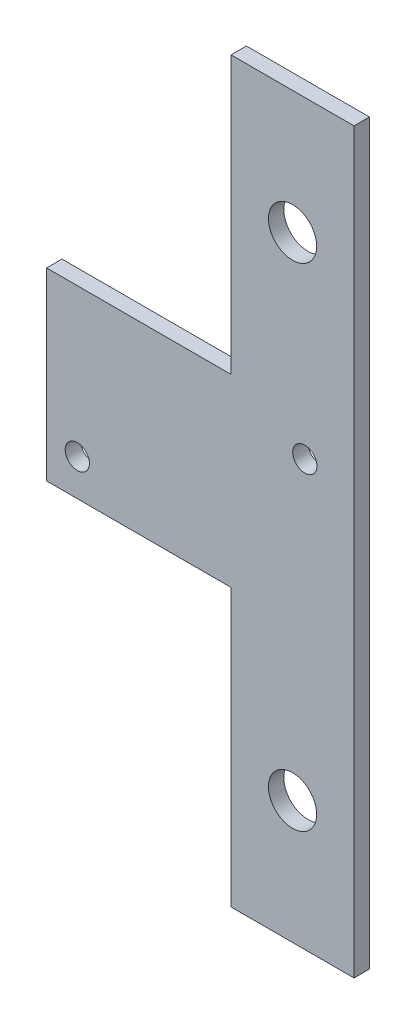
ISO-10303-21;
HEADER;
FILE_DESCRIPTION(('STEP AP214'),'2;1');
FILE_NAME('part.step','',(''),(''),'','','');
FILE_SCHEMA(('AUTOMOTIVE_DESIGN { 1 0 10303 214 1 1 1 1 }'));
ENDSEC;
DATA;
#1=APPLICATION_CONTEXT('core data for automotive mechanical design processes');
#2=APPLICATION_PROTOCOL_DEFINITION('international standard','automotive_design',2000,#1);
#3=PRODUCT_CONTEXT('',#1,'mechanical');
#4=PRODUCT('Part','Part','',(#3));
#5=PRODUCT_RELATED_PRODUCT_CATEGORY('part','',(#4));
#6=PRODUCT_DEFINITION_FORMATION('','',#4);
#7=PRODUCT_DEFINITION_CONTEXT('part definition',#1,'design');
#8=PRODUCT_DEFINITION('design','',#6,#7);
#9=PRODUCT_DEFINITION_SHAPE('','',#8);
#10=(LENGTH_UNIT() NAMED_UNIT(*) SI_UNIT(.MILLI.,.METRE.));
#11=(NAMED_UNIT(*) PLANE_ANGLE_UNIT() SI_UNIT($,.RADIAN.));
#12=(NAMED_UNIT(*) SI_UNIT($,.STERADIAN.) SOLID_ANGLE_UNIT());
#13=UNCERTAINTY_MEASURE_WITH_UNIT(LENGTH_MEASURE(1.E-05),#10,'distance_accuracy_value','');
#14=(GEOMETRIC_REPRESENTATION_CONTEXT(3) GLOBAL_UNCERTAINTY_ASSIGNED_CONTEXT((#13)) GLOBAL_UNIT_ASSIGNED_CONTEXT((#10,
#11,#12)) REPRESENTATION_CONTEXT('',''));
#15=CARTESIAN_POINT('',(0.,0.,0.));
#16=DIRECTION('',(0.,0.,1.));
#17=DIRECTION('',(1.,0.,0.));
#18=AXIS2_PLACEMENT_3D('',#15,#16,#17);
#19=CARTESIAN_POINT('',(0.,0.,1.5875));
#20=DIRECTION('',(0.,0.,-1.));
#21=DIRECTION('',(-1.,0.,0.));
#22=AXIS2_PLACEMENT_3D('',#19,#20,#21);
#23=PLANE('',#22);
#24=DIRECTION('',(0.,1.,0.));
#25=VECTOR('',#24,1.);
#26=CARTESIAN_POINT('',(-12.3843317987591,1046.594541193,1.5875));
#27=LINE('',#26,#25);
#28=CARTESIAN_POINT('',(-12.3843317987591,970.394541192996,1.5875));
#29=VERTEX_POINT('',#28);
#30=CARTESIAN_POINT('',(-12.3843317987591,1046.594541193,1.5875));
#31=VERTEX_POINT('',#30);
#32=EDGE_CURVE('E146',#29,#31,#27,.T.);
#33=ORIENTED_EDGE('',*,*,#32,.T.);
#34=DIRECTION('',(-1.,0.,0.));
#35=VECTOR('',#34,1.);
#36=CARTESIAN_POINT('',(-25.0843317987591,1046.594541193,1.5875));
#37=LINE('',#36,#35);
#38=CARTESIAN_POINT('',(-25.0843317987591,1046.594541193,1.5875));
#39=VERTEX_POINT('',#38);
#40=EDGE_CURVE('E94',#31,#39,#37,.T.);
#41=ORIENTED_EDGE('',*,*,#40,.T.);
#42=DIRECTION('',(0.,-1.,0.));
#43=VECTOR('',#42,1.);
#44=CARTESIAN_POINT('',(-25.0843317987591,1018.019541193,1.5875));
#45=LINE('',#44,#43);
#46=CARTESIAN_POINT('',(-25.0843317987591,1018.019541193,1.5875));
#47=VERTEX_POINT('',#46);
#48=EDGE_CURVE('E161',#39,#47,#45,.T.);
#49=ORIENTED_EDGE('',*,*,#48,.T.);
#50=DIRECTION('',(-1.,0.,0.));
#51=VECTOR('',#50,1.);
#52=CARTESIAN_POINT('',(-44.1343317987591,1018.019541193,1.5875));
#53=LINE('',#52,#51);
#54=CARTESIAN_POINT('',(-44.1343317987591,1018.019541193,1.5875));
#55=VERTEX_POINT('',#54);
#56=EDGE_CURVE('E174',#47,#55,#53,.T.);
#57=ORIENTED_EDGE('',*,*,#56,.T.);
#58=DIRECTION('',(0.,-1.,0.));
#59=VECTOR('',#58,1.);
#60=CARTESIAN_POINT('',(-44.1343317987591,998.969541192996,1.5875));
#61=LINE('',#60,#59);
#62=CARTESIAN_POINT('',(-44.1343317987591,998.969541192996,1.5875));
#63=VERTEX_POINT('',#62);
#64=EDGE_CURVE('E113',#55,#63,#61,.T.);
#65=ORIENTED_EDGE('',*,*,#64,.T.);
#66=DIRECTION('',(1.,0.,0.));
#67=VECTOR('',#66,1.);
#68=CARTESIAN_POINT('',(-25.0843317987591,998.969541192996,1.5875));
#69=LINE('',#68,#67);
#70=CARTESIAN_POINT('',(-25.0843317987591,998.969541192996,1.5875));
#71=VERTEX_POINT('',#70);
#72=EDGE_CURVE('E107',#63,#71,#69,.T.);
#73=ORIENTED_EDGE('',*,*,#72,.T.);
#74=DIRECTION('',(0.,-1.,0.));
#75=VECTOR('',#74,1.);
#76=CARTESIAN_POINT('',(-25.0843317987591,970.394541192996,1.5875));
#77=LINE('',#76,#75);
#78=CARTESIAN_POINT('',(-25.0843317987591,970.394541192996,1.5875));
#79=VERTEX_POINT('',#78);
#80=EDGE_CURVE('E111',#71,#79,#77,.T.);
#81=ORIENTED_EDGE('',*,*,#80,.T.);
#82=DIRECTION('',(1.,0.,0.));
#83=VECTOR('',#82,1.);
#84=CARTESIAN_POINT('',(-12.3843317987591,970.394541192996,1.5875));
#85=LINE('',#84,#83);
#86=EDGE_CURVE('E51',#79,#29,#85,.T.);
#87=ORIENTED_EDGE('',*,*,#86,.T.);
#88=EDGE_LOOP('',(#33,#41,#49,#57,#65,#73,#81,#87));
#89=FACE_BOUND('',#88,.T.);
#90=CARTESIAN_POINT('',(-18.7343317987591,983.094541192996,1.5875));
#91=DIRECTION('',(0.,0.,1.));
#92=DIRECTION('',(1.,0.,0.));
#93=AXIS2_PLACEMENT_3D('',#90,#91,#92);
#94=CIRCLE('',#93,2.48919999999997);
#95=CARTESIAN_POINT('',(-16.2451317987591,983.094541192996,1.5875));
#96=VERTEX_POINT('',#95);
#97=EDGE_CURVE('E135',#96,#96,#94,.T.);
#98=ORIENTED_EDGE('',*,*,#97,.F.);
#99=EDGE_LOOP('',(#98));
#100=FACE_BOUND('',#99,.T.);
#101=CARTESIAN_POINT('',(-18.7343317987591,1033.894541193,1.5875));
#102=DIRECTION('',(0.,0.,1.));
#103=DIRECTION('',(1.,0.,0.));
#104=AXIS2_PLACEMENT_3D('',#101,#102,#103);
#105=CIRCLE('',#104,2.48920000000004);
#106=CARTESIAN_POINT('',(-16.2451317987591,1033.894541193,1.5875));
#107=VERTEX_POINT('',#106);
#108=EDGE_CURVE('E183',#107,#107,#105,.T.);
#109=ORIENTED_EDGE('',*,*,#108,.F.);
#110=EDGE_LOOP('',(#109));
#111=FACE_BOUND('',#110,.T.);
#112=CARTESIAN_POINT('',(-40.9593317987591,1002.73627543313,1.5875));
#113=DIRECTION('',(0.,0.,1.));
#114=DIRECTION('',(1.,0.,0.));
#115=AXIS2_PLACEMENT_3D('',#112,#113,#114);
#116=CIRCLE('',#115,1.25000000000005);
#117=CARTESIAN_POINT('',(-39.709331798759,1002.73627543313,1.5875));
#118=VERTEX_POINT('',#117);
#119=EDGE_CURVE('E189',#118,#118,#116,.T.);
#120=ORIENTED_EDGE('',*,*,#119,.F.);
#121=EDGE_LOOP('',(#120));
#122=FACE_BOUND('',#121,.T.);
#123=CARTESIAN_POINT('',(-17.4674288207591,1014.25280695286,1.5875));
#124=DIRECTION('',(0.,0.,1.));
#125=DIRECTION('',(1.,0.,0.));
#126=AXIS2_PLACEMENT_3D('',#123,#124,#125);
#127=CIRCLE('',#126,1.25000000000019);
#128=CARTESIAN_POINT('',(-16.2174288207589,1014.25280695286,1.5875));
#129=VERTEX_POINT('',#128);
#130=EDGE_CURVE('E195',#129,#129,#127,.T.);
#131=ORIENTED_EDGE('',*,*,#130,.F.);
#132=EDGE_LOOP('',(#131));
#133=FACE_BOUND('',#132,.T.);
#134=ADVANCED_FACE('F34',(#89,#100,#111,#122,#133),#23,.F.);
#135=CARTESIAN_POINT('',(0.,0.,0.));
#136=DIRECTION('',(0.,0.,-1.));
#137=DIRECTION('',(-1.,0.,0.));
#138=AXIS2_PLACEMENT_3D('',#135,#136,#137);
#139=PLANE('',#138);
#140=CARTESIAN_POINT('',(-40.9593317987591,1002.73627543313,0.));
#141=DIRECTION('',(0.,0.,1.));
#142=DIRECTION('',(1.,0.,0.));
#143=AXIS2_PLACEMENT_3D('',#140,#141,#142);
#144=CIRCLE('',#143,1.25000000000005);
#145=CARTESIAN_POINT('',(-39.709331798759,1002.73627543313,0.));
#146=VERTEX_POINT('',#145);
#147=EDGE_CURVE('E192',#146,#146,#144,.T.);
#148=ORIENTED_EDGE('',*,*,#147,.T.);
#149=EDGE_LOOP('',(#148));
#150=FACE_BOUND('',#149,.T.);
#151=CARTESIAN_POINT('',(-18.7343317987591,983.094541192996,0.));
#152=DIRECTION('',(0.,0.,1.));
#153=DIRECTION('',(1.,0.,0.));
#154=AXIS2_PLACEMENT_3D('',#151,#152,#153);
#155=CIRCLE('',#154,2.48919999999997);
#156=CARTESIAN_POINT('',(-16.2451317987591,983.094541192996,0.));
#157=VERTEX_POINT('',#156);
#158=EDGE_CURVE('E180',#157,#157,#155,.T.);
#159=ORIENTED_EDGE('',*,*,#158,.T.);
#160=EDGE_LOOP('',(#159));
#161=FACE_BOUND('',#160,.T.);
#162=DIRECTION('',(0.,1.,0.));
#163=VECTOR('',#162,1.);
#164=CARTESIAN_POINT('',(-12.3843317987591,1046.594541193,0.));
#165=LINE('',#164,#163);
#166=CARTESIAN_POINT('',(-12.3843317987591,970.394541192996,0.));
#167=VERTEX_POINT('',#166);
#168=CARTESIAN_POINT('',(-12.3843317987591,1046.594541193,0.));
#169=VERTEX_POINT('',#168);
#170=EDGE_CURVE('E131',#167,#169,#165,.T.);
#171=ORIENTED_EDGE('',*,*,#170,.F.);
#172=DIRECTION('',(1.,0.,0.));
#173=VECTOR('',#172,1.);
#174=CARTESIAN_POINT('',(-12.3843317987591,970.394541192996,0.));
#175=LINE('',#174,#173);
#176=CARTESIAN_POINT('',(-25.0843317987591,970.394541192996,0.));
#177=VERTEX_POINT('',#176);
#178=EDGE_CURVE('E86',#177,#167,#175,.T.);
#179=ORIENTED_EDGE('',*,*,#178,.F.);
#180=DIRECTION('',(0.,-1.,0.));
#181=VECTOR('',#180,1.);
#182=CARTESIAN_POINT('',(-25.0843317987591,970.394541192996,0.));
#183=LINE('',#182,#181);
#184=CARTESIAN_POINT('',(-25.0843317987591,998.969541192996,0.));
#185=VERTEX_POINT('',#184);
#186=EDGE_CURVE('E80',#185,#177,#183,.T.);
#187=ORIENTED_EDGE('',*,*,#186,.F.);
#188=DIRECTION('',(1.,0.,0.));
#189=VECTOR('',#188,1.);
#190=CARTESIAN_POINT('',(-25.0843317987591,998.969541192996,0.));
#191=LINE('',#190,#189);
#192=CARTESIAN_POINT('',(-44.1343317987591,998.969541192996,0.));
#193=VERTEX_POINT('',#192);
#194=EDGE_CURVE('E121',#193,#185,#191,.T.);
#195=ORIENTED_EDGE('',*,*,#194,.F.);
#196=DIRECTION('',(0.,-1.,0.));
#197=VECTOR('',#196,1.);
#198=CARTESIAN_POINT('',(-44.1343317987591,998.969541192996,0.));
#199=LINE('',#198,#197);
#200=CARTESIAN_POINT('',(-44.1343317987591,1018.019541193,0.));
#201=VERTEX_POINT('',#200);
#202=EDGE_CURVE('E141',#201,#193,#199,.T.);
#203=ORIENTED_EDGE('',*,*,#202,.F.);
#204=DIRECTION('',(-1.,0.,0.));
#205=VECTOR('',#204,1.);
#206=CARTESIAN_POINT('',(-44.1343317987591,1018.019541193,0.));
#207=LINE('',#206,#205);
#208=CARTESIAN_POINT('',(-25.0843317987591,1018.019541193,0.));
#209=VERTEX_POINT('',#208);
#210=EDGE_CURVE('E139',#209,#201,#207,.T.);
#211=ORIENTED_EDGE('',*,*,#210,.F.);
#212=DIRECTION('',(0.,-1.,0.));
#213=VECTOR('',#212,1.);
#214=CARTESIAN_POINT('',(-25.0843317987591,1018.019541193,0.));
#215=LINE('',#214,#213);
#216=CARTESIAN_POINT('',(-25.0843317987591,1046.594541193,0.));
#217=VERTEX_POINT('',#216);
#218=EDGE_CURVE('E137',#217,#209,#215,.T.);
#219=ORIENTED_EDGE('',*,*,#218,.F.);
#220=DIRECTION('',(-1.,0.,0.));
#221=VECTOR('',#220,1.);
#222=CARTESIAN_POINT('',(-25.0843317987591,1046.594541193,0.));
#223=LINE('',#222,#221);
#224=EDGE_CURVE('E134',#169,#217,#223,.T.);
#225=ORIENTED_EDGE('',*,*,#224,.F.);
#226=EDGE_LOOP('',(#171,#179,#187,#195,#203,#211,#219,#225));
#227=FACE_BOUND('',#226,.T.);
#228=CARTESIAN_POINT('',(-18.7343317987591,1033.894541193,0.));
#229=DIRECTION('',(0.,0.,1.));
#230=DIRECTION('',(1.,0.,0.));
#231=AXIS2_PLACEMENT_3D('',#228,#229,#230);
#232=CIRCLE('',#231,2.48920000000004);
#233=CARTESIAN_POINT('',(-16.2451317987591,1033.894541193,0.));
#234=VERTEX_POINT('',#233);
#235=EDGE_CURVE('E186',#234,#234,#232,.T.);
#236=ORIENTED_EDGE('',*,*,#235,.T.);
#237=EDGE_LOOP('',(#236));
#238=FACE_BOUND('',#237,.T.);
#239=CARTESIAN_POINT('',(-17.4674288207591,1014.25280695286,0.));
#240=DIRECTION('',(0.,0.,1.));
#241=DIRECTION('',(1.,0.,0.));
#242=AXIS2_PLACEMENT_3D('',#239,#240,#241);
#243=CIRCLE('',#242,1.25000000000019);
#244=CARTESIAN_POINT('',(-16.2174288207589,1014.25280695286,0.));
#245=VERTEX_POINT('',#244);
#246=EDGE_CURVE('E198',#245,#245,#243,.T.);
#247=ORIENTED_EDGE('',*,*,#246,.T.);
#248=EDGE_LOOP('',(#247));
#249=FACE_BOUND('',#248,.T.);
#250=ADVANCED_FACE('F165',(#150,#161,#227,#238,#249),#139,.T.);
#251=CARTESIAN_POINT('',(-12.3843317987591,1046.594541193,1.5875));
#252=DIRECTION('',(-1.,0.,0.));
#253=DIRECTION('',(0.,-1.,0.));
#254=AXIS2_PLACEMENT_3D('',#251,#252,#253);
#255=PLANE('',#254);
#256=ORIENTED_EDGE('',*,*,#170,.T.);
#257=DIRECTION('',(0.,0.,-1.));
#258=VECTOR('',#257,1.);
#259=CARTESIAN_POINT('',(-12.3843317987591,1046.594541193,1.5875));
#260=LINE('',#259,#258);
#261=EDGE_CURVE('E11',#31,#169,#260,.T.);
#262=ORIENTED_EDGE('',*,*,#261,.F.);
#263=ORIENTED_EDGE('',*,*,#32,.F.);
#264=DIRECTION('',(0.,0.,-1.));
#265=VECTOR('',#264,1.);
#266=CARTESIAN_POINT('',(-12.3843317987591,970.394541192996,1.5875));
#267=LINE('',#266,#265);
#268=EDGE_CURVE('E127',#29,#167,#267,.T.);
#269=ORIENTED_EDGE('',*,*,#268,.T.);
#270=EDGE_LOOP('',(#256,#262,#263,#269));
#271=FACE_BOUND('',#270,.T.);
#272=ADVANCED_FACE('F36',(#271),#255,.F.);
#273=CARTESIAN_POINT('',(-25.0843317987591,1046.594541193,1.5875));
#274=DIRECTION('',(0.,-1.,0.));
#275=DIRECTION('',(1.,0.,0.));
#276=AXIS2_PLACEMENT_3D('',#273,#274,#275);
#277=PLANE('',#276);
#278=ORIENTED_EDGE('',*,*,#224,.T.);
#279=DIRECTION('',(0.,0.,-1.));
#280=VECTOR('',#279,1.);
#281=CARTESIAN_POINT('',(-25.0843317987591,1046.594541193,1.5875));
#282=LINE('',#281,#280);
#283=EDGE_CURVE('E43',#39,#217,#282,.T.);
#284=ORIENTED_EDGE('',*,*,#283,.F.);
#285=ORIENTED_EDGE('',*,*,#40,.F.);
#286=ORIENTED_EDGE('',*,*,#261,.T.);
#287=EDGE_LOOP('',(#278,#284,#285,#286));
#288=FACE_BOUND('',#287,.T.);
#289=ADVANCED_FACE('F230',(#288),#277,.F.);
#290=CARTESIAN_POINT('',(-25.0843317987591,1018.019541193,1.5875));
#291=DIRECTION('',(1.,0.,0.));
#292=DIRECTION('',(0.,1.,0.));
#293=AXIS2_PLACEMENT_3D('',#290,#291,#292);
#294=PLANE('',#293);
#295=ORIENTED_EDGE('',*,*,#218,.T.);
#296=DIRECTION('',(0.,0.,-1.));
#297=VECTOR('',#296,1.);
#298=CARTESIAN_POINT('',(-25.0843317987591,1018.019541193,1.5875));
#299=LINE('',#298,#297);
#300=EDGE_CURVE('E153',#47,#209,#299,.T.);
#301=ORIENTED_EDGE('',*,*,#300,.F.);
#302=ORIENTED_EDGE('',*,*,#48,.F.);
#303=ORIENTED_EDGE('',*,*,#283,.T.);
#304=EDGE_LOOP('',(#295,#301,#302,#303));
#305=FACE_BOUND('',#304,.T.);
#306=ADVANCED_FACE('F159',(#305),#294,.F.);
#307=CARTESIAN_POINT('',(-44.1343317987591,1018.019541193,1.5875));
#308=DIRECTION('',(0.,-1.,0.));
#309=DIRECTION('',(0.,0.,-1.));
#310=AXIS2_PLACEMENT_3D('',#307,#308,#309);
#311=PLANE('',#310);
#312=ORIENTED_EDGE('',*,*,#210,.T.);
#313=DIRECTION('',(0.,0.,-1.));
#314=VECTOR('',#313,1.);
#315=CARTESIAN_POINT('',(-44.1343317987591,1018.019541193,1.5875));
#316=LINE('',#315,#314);
#317=EDGE_CURVE('E150',#55,#201,#316,.T.);
#318=ORIENTED_EDGE('',*,*,#317,.F.);
#319=ORIENTED_EDGE('',*,*,#56,.F.);
#320=ORIENTED_EDGE('',*,*,#300,.T.);
#321=EDGE_LOOP('',(#312,#318,#319,#320));
#322=FACE_BOUND('',#321,.T.);
#323=ADVANCED_FACE('F170',(#322),#311,.F.);
#324=CARTESIAN_POINT('',(-44.1343317987591,998.969541192996,1.5875));
#325=DIRECTION('',(1.,0.,0.));
#326=DIRECTION('',(0.,1.,0.));
#327=AXIS2_PLACEMENT_3D('',#324,#325,#326);
#328=PLANE('',#327);
#329=ORIENTED_EDGE('',*,*,#202,.T.);
#330=DIRECTION('',(0.,0.,-1.));
#331=VECTOR('',#330,1.);
#332=CARTESIAN_POINT('',(-44.1343317987591,998.969541192996,1.5875));
#333=LINE('',#332,#331);
#334=EDGE_CURVE('E122',#63,#193,#333,.T.);
#335=ORIENTED_EDGE('',*,*,#334,.F.);
#336=ORIENTED_EDGE('',*,*,#64,.F.);
#337=ORIENTED_EDGE('',*,*,#317,.T.);
#338=EDGE_LOOP('',(#329,#335,#336,#337));
#339=FACE_BOUND('',#338,.T.);
#340=ADVANCED_FACE('F173',(#339),#328,.F.);
#341=CARTESIAN_POINT('',(-25.0843317987591,998.969541192996,1.5875));
#342=DIRECTION('',(0.,1.,0.));
#343=DIRECTION('',(-1.,0.,0.));
#344=AXIS2_PLACEMENT_3D('',#341,#342,#343);
#345=PLANE('',#344);
#346=ORIENTED_EDGE('',*,*,#194,.T.);
#347=DIRECTION('',(0.,0.,-1.));
#348=VECTOR('',#347,1.);
#349=CARTESIAN_POINT('',(-25.0843317987591,998.969541192996,1.5875));
#350=LINE('',#349,#348);
#351=EDGE_CURVE('E118',#71,#185,#350,.T.);
#352=ORIENTED_EDGE('',*,*,#351,.F.);
#353=ORIENTED_EDGE('',*,*,#72,.F.);
#354=ORIENTED_EDGE('',*,*,#334,.T.);
#355=EDGE_LOOP('',(#346,#352,#353,#354));
#356=FACE_BOUND('',#355,.T.);
#357=ADVANCED_FACE('F119',(#356),#345,.F.);
#358=CARTESIAN_POINT('',(-25.0843317987591,970.394541192996,1.5875));
#359=DIRECTION('',(1.,0.,0.));
#360=DIRECTION('',(0.,1.,0.));
#361=AXIS2_PLACEMENT_3D('',#358,#359,#360);
#362=PLANE('',#361);
#363=ORIENTED_EDGE('',*,*,#186,.T.);
#364=DIRECTION('',(0.,0.,-1.));
#365=VECTOR('',#364,1.);
#366=CARTESIAN_POINT('',(-25.0843317987591,970.394541192996,1.5875));
#367=LINE('',#366,#365);
#368=EDGE_CURVE('E123',#79,#177,#367,.T.);
#369=ORIENTED_EDGE('',*,*,#368,.F.);
#370=ORIENTED_EDGE('',*,*,#80,.F.);
#371=ORIENTED_EDGE('',*,*,#351,.T.);
#372=EDGE_LOOP('',(#363,#369,#370,#371));
#373=FACE_BOUND('',#372,.T.);
#374=ADVANCED_FACE('F125',(#373),#362,.F.);
#375=CARTESIAN_POINT('',(-12.3843317987591,970.394541192996,1.5875));
#376=DIRECTION('',(0.,1.,0.));
#377=DIRECTION('',(-1.,0.,0.));
#378=AXIS2_PLACEMENT_3D('',#375,#376,#377);
#379=PLANE('',#378);
#380=ORIENTED_EDGE('',*,*,#178,.T.);
#381=ORIENTED_EDGE('',*,*,#268,.F.);
#382=ORIENTED_EDGE('',*,*,#86,.F.);
#383=ORIENTED_EDGE('',*,*,#368,.T.);
#384=EDGE_LOOP('',(#380,#381,#382,#383));
#385=FACE_BOUND('',#384,.T.);
#386=ADVANCED_FACE('F218',(#385),#379,.F.);
#387=CARTESIAN_POINT('',(-18.7343317987591,983.094541192996,1.5875));
#388=DIRECTION('',(0.,0.,-1.));
#389=DIRECTION('',(-1.,0.,0.));
#390=AXIS2_PLACEMENT_3D('',#387,#388,#389);
#391=CYLINDRICAL_SURFACE('',#390,2.48919999999997);
#392=ORIENTED_EDGE('',*,*,#97,.T.);
#393=EDGE_LOOP('',(#392));
#394=FACE_BOUND('',#393,.T.);
#395=ORIENTED_EDGE('',*,*,#158,.F.);
#396=EDGE_LOOP('',(#395));
#397=FACE_BOUND('',#396,.T.);
#398=ADVANCED_FACE('F215',(#394,#397),#391,.F.);
#399=CARTESIAN_POINT('',(-18.7343317987591,1033.894541193,1.5875));
#400=DIRECTION('',(0.,0.,-1.));
#401=DIRECTION('',(-1.,0.,0.));
#402=AXIS2_PLACEMENT_3D('',#399,#400,#401);
#403=CYLINDRICAL_SURFACE('',#402,2.48920000000004);
#404=ORIENTED_EDGE('',*,*,#108,.T.);
#405=EDGE_LOOP('',(#404));
#406=FACE_BOUND('',#405,.T.);
#407=ORIENTED_EDGE('',*,*,#235,.F.);
#408=EDGE_LOOP('',(#407));
#409=FACE_BOUND('',#408,.T.);
#410=ADVANCED_FACE('F294',(#406,#409),#403,.F.);
#411=CARTESIAN_POINT('',(-40.9593317987591,1002.73627543313,1.5875));
#412=DIRECTION('',(0.,0.,-1.));
#413=DIRECTION('',(-1.,0.,0.));
#414=AXIS2_PLACEMENT_3D('',#411,#412,#413);
#415=CYLINDRICAL_SURFACE('',#414,1.25000000000005);
#416=ORIENTED_EDGE('',*,*,#119,.T.);
#417=EDGE_LOOP('',(#416));
#418=FACE_BOUND('',#417,.T.);
#419=ORIENTED_EDGE('',*,*,#147,.F.);
#420=EDGE_LOOP('',(#419));
#421=FACE_BOUND('',#420,.T.);
#422=ADVANCED_FACE('F302',(#418,#421),#415,.F.);
#423=CARTESIAN_POINT('',(-17.4674288207591,1014.25280695286,1.5875));
#424=DIRECTION('',(0.,0.,-1.));
#425=DIRECTION('',(-1.,0.,0.));
#426=AXIS2_PLACEMENT_3D('',#423,#424,#425);
#427=CYLINDRICAL_SURFACE('',#426,1.25000000000019);
#428=ORIENTED_EDGE('',*,*,#130,.T.);
#429=EDGE_LOOP('',(#428));
#430=FACE_BOUND('',#429,.T.);
#431=ORIENTED_EDGE('',*,*,#246,.F.);
#432=EDGE_LOOP('',(#431));
#433=FACE_BOUND('',#432,.T.);
#434=ADVANCED_FACE('F204',(#430,#433),#427,.F.);
#435=CLOSED_SHELL('',(#134,#250,#272,#289,#306,#323,#340,#357,#374,#386,#398,#410,#422,#434));
#436=MANIFOLD_SOLID_BREP('B2',#435);
#437=ADVANCED_BREP_SHAPE_REPRESENTATION('',(#18,#436),#14);
#438=SHAPE_DEFINITION_REPRESENTATION(#9,#437);
ENDSEC;
END-ISO-10303-21;
